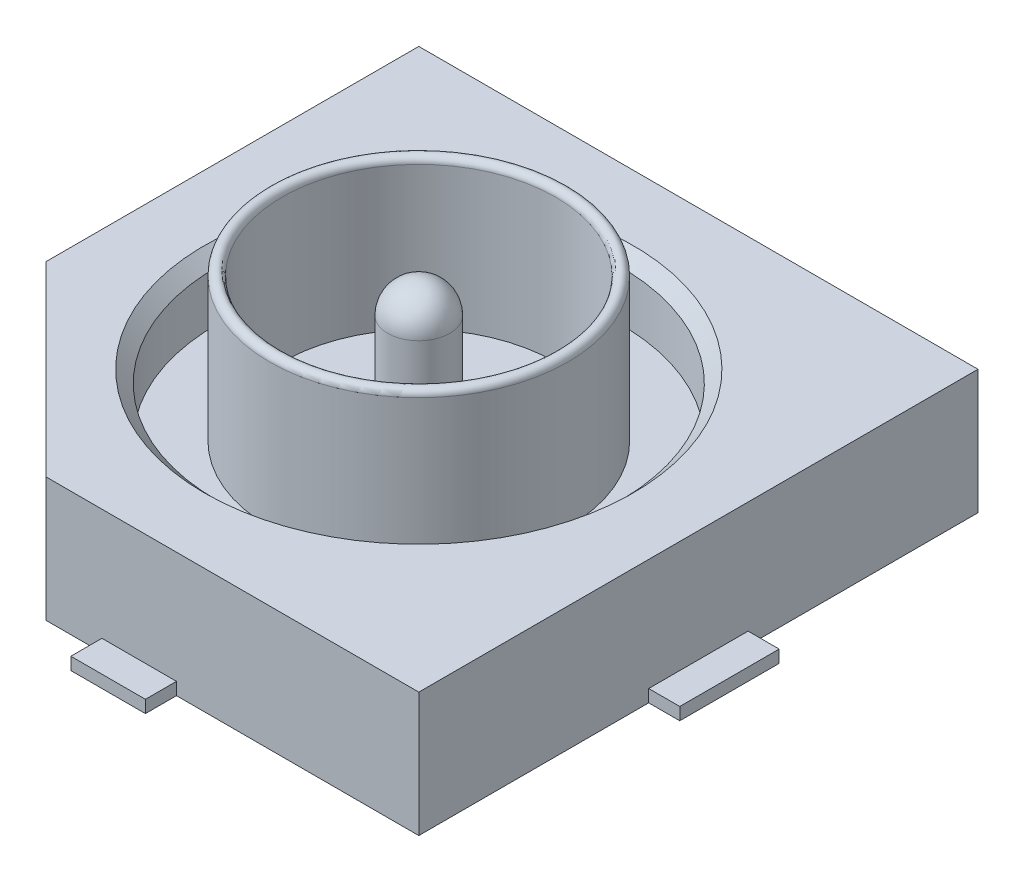
ISO-10303-21;
HEADER;
FILE_DESCRIPTION(('STEP AP214'),'2;1');
FILE_NAME('part.step','',(''),(''),'','','');
FILE_SCHEMA(('AUTOMOTIVE_DESIGN { 1 0 10303 214 1 1 1 1 }'));
ENDSEC;
DATA;
#1=APPLICATION_CONTEXT('core data for automotive mechanical design processes');
#2=APPLICATION_PROTOCOL_DEFINITION('international standard','automotive_design',2000,#1);
#3=PRODUCT_CONTEXT('',#1,'mechanical');
#4=PRODUCT('Part','Part','',(#3));
#5=PRODUCT_RELATED_PRODUCT_CATEGORY('part','',(#4));
#6=PRODUCT_DEFINITION_FORMATION('','',#4);
#7=PRODUCT_DEFINITION_CONTEXT('part definition',#1,'design');
#8=PRODUCT_DEFINITION('design','',#6,#7);
#9=PRODUCT_DEFINITION_SHAPE('','',#8);
#10=(LENGTH_UNIT() NAMED_UNIT(*) SI_UNIT(.MILLI.,.METRE.));
#11=(NAMED_UNIT(*) PLANE_ANGLE_UNIT() SI_UNIT($,.RADIAN.));
#12=(NAMED_UNIT(*) SI_UNIT($,.STERADIAN.) SOLID_ANGLE_UNIT());
#13=UNCERTAINTY_MEASURE_WITH_UNIT(LENGTH_MEASURE(1.E-05),#10,'distance_accuracy_value','');
#14=(GEOMETRIC_REPRESENTATION_CONTEXT(3) GLOBAL_UNCERTAINTY_ASSIGNED_CONTEXT((#13)) GLOBAL_UNIT_ASSIGNED_CONTEXT((#10,
#11,#12)) REPRESENTATION_CONTEXT('',''));
#15=CARTESIAN_POINT('',(0.,0.,0.));
#16=DIRECTION('',(0.,0.,1.));
#17=DIRECTION('',(1.,0.,0.));
#18=AXIS2_PLACEMENT_3D('',#15,#16,#17);
#19=CARTESIAN_POINT('',(0.,1.65,0.));
#20=DIRECTION('',(0.,-1.,0.));
#21=DIRECTION('',(0.,0.,-1.));
#22=AXIS2_PLACEMENT_3D('',#19,#20,#21);
#23=TOROIDAL_SURFACE('',#22,1.15,0.05);
#24=CARTESIAN_POINT('',(0.,1.65,0.));
#25=DIRECTION('',(0.,-1.,0.));
#26=DIRECTION('',(0.,0.,-1.));
#27=AXIS2_PLACEMENT_3D('',#24,#25,#26);
#28=CIRCLE('',#27,1.1);
#29=CARTESIAN_POINT('',(0.,1.65,-1.1));
#30=VERTEX_POINT('',#29);
#31=EDGE_CURVE('E360',#30,#30,#28,.F.);
#32=ORIENTED_EDGE('',*,*,#31,.F.);
#33=EDGE_LOOP('',(#32));
#34=FACE_BOUND('',#33,.T.);
#35=CARTESIAN_POINT('',(0.,1.65,0.));
#36=DIRECTION('',(0.,-1.,0.));
#37=DIRECTION('',(0.,0.,-1.));
#38=AXIS2_PLACEMENT_3D('',#35,#36,#37);
#39=CIRCLE('',#38,1.2);
#40=CARTESIAN_POINT('',(0.,1.65,-1.2));
#41=VERTEX_POINT('',#40);
#42=EDGE_CURVE('E365',#41,#41,#39,.T.);
#43=ORIENTED_EDGE('',*,*,#42,.F.);
#44=EDGE_LOOP('',(#43));
#45=FACE_BOUND('',#44,.T.);
#46=ADVANCED_FACE('F70',(#34,#45),#23,.T.);
#47=CARTESIAN_POINT('',(0.,1.7,0.));
#48=DIRECTION('',(0.,-1.,0.));
#49=DIRECTION('',(0.,0.,-1.));
#50=AXIS2_PLACEMENT_3D('',#47,#48,#49);
#51=CYLINDRICAL_SURFACE('',#50,1.2);
#52=ORIENTED_EDGE('',*,*,#42,.T.);
#53=EDGE_LOOP('',(#52));
#54=FACE_BOUND('',#53,.T.);
#55=CARTESIAN_POINT('',(0.,0.5,0.));
#56=DIRECTION('',(0.,1.,0.));
#57=DIRECTION('',(0.,0.,1.));
#58=AXIS2_PLACEMENT_3D('',#55,#56,#57);
#59=CIRCLE('',#58,1.2);
#60=CARTESIAN_POINT('',(0.,0.5,1.2));
#61=VERTEX_POINT('',#60);
#62=EDGE_CURVE('E324',#61,#61,#59,.T.);
#63=ORIENTED_EDGE('',*,*,#62,.T.);
#64=EDGE_LOOP('',(#63));
#65=FACE_BOUND('',#64,.T.);
#66=ADVANCED_FACE('F437',(#54,#65),#51,.T.);
#67=CARTESIAN_POINT('',(0.,1.7,0.));
#68=DIRECTION('',(0.,-1.,0.));
#69=DIRECTION('',(0.,0.,-1.));
#70=AXIS2_PLACEMENT_3D('',#67,#68,#69);
#71=CYLINDRICAL_SURFACE('',#70,1.1);
#72=ORIENTED_EDGE('',*,*,#31,.T.);
#73=EDGE_LOOP('',(#72));
#74=FACE_BOUND('',#73,.T.);
#75=CARTESIAN_POINT('',(0.,0.5,0.));
#76=DIRECTION('',(0.,1.,0.));
#77=DIRECTION('',(0.,0.,1.));
#78=AXIS2_PLACEMENT_3D('',#75,#76,#77);
#79=CIRCLE('',#78,1.1);
#80=CARTESIAN_POINT('',(0.,0.5,1.1));
#81=VERTEX_POINT('',#80);
#82=EDGE_CURVE('E318',#81,#81,#79,.T.);
#83=ORIENTED_EDGE('',*,*,#82,.F.);
#84=EDGE_LOOP('',(#83));
#85=FACE_BOUND('',#84,.T.);
#86=ADVANCED_FACE('F443',(#74,#85),#71,.F.);
#87=CARTESIAN_POINT('',(0.,0.5,0.));
#88=DIRECTION('',(0.,1.,0.));
#89=DIRECTION('',(0.,0.,1.));
#90=AXIS2_PLACEMENT_3D('',#87,#88,#89);
#91=CYLINDRICAL_SURFACE('',#90,1.625);
#92=CARTESIAN_POINT('',(0.,0.900000000000001,0.));
#93=DIRECTION('',(0.,1.,0.));
#94=DIRECTION('',(0.,0.,1.));
#95=AXIS2_PLACEMENT_3D('',#92,#93,#94);
#96=CIRCLE('',#95,1.625);
#97=CARTESIAN_POINT('',(0.,0.900000000000001,1.625));
#98=VERTEX_POINT('',#97);
#99=EDGE_CURVE('E368',#98,#98,#96,.T.);
#100=ORIENTED_EDGE('',*,*,#99,.T.);
#101=EDGE_LOOP('',(#100));
#102=FACE_BOUND('',#101,.T.);
#103=CARTESIAN_POINT('',(0.,0.5,0.));
#104=DIRECTION('',(0.,1.,0.));
#105=DIRECTION('',(0.,0.,1.));
#106=AXIS2_PLACEMENT_3D('',#103,#104,#105);
#107=CIRCLE('',#106,1.625);
#108=CARTESIAN_POINT('',(0.,0.5,1.625));
#109=VERTEX_POINT('',#108);
#110=EDGE_CURVE('E327',#109,#109,#107,.T.);
#111=ORIENTED_EDGE('',*,*,#110,.F.);
#112=EDGE_LOOP('',(#111));
#113=FACE_BOUND('',#112,.T.);
#114=ADVANCED_FACE('F466',(#102,#113),#91,.F.);
#115=CARTESIAN_POINT('',(0.,0.5,0.));
#116=DIRECTION('',(0.,1.,0.));
#117=DIRECTION('',(0.,0.,1.));
#118=AXIS2_PLACEMENT_3D('',#115,#116,#117);
#119=PLANE('',#118);
#120=ORIENTED_EDGE('',*,*,#62,.F.);
#121=EDGE_LOOP('',(#120));
#122=FACE_BOUND('',#121,.T.);
#123=ORIENTED_EDGE('',*,*,#110,.T.);
#124=EDGE_LOOP('',(#123));
#125=FACE_BOUND('',#124,.T.);
#126=ADVANCED_FACE('F469',(#122,#125),#119,.T.);
#127=CARTESIAN_POINT('',(-2.25,0.,2.25));
#128=DIRECTION('',(0.,1.,0.));
#129=DIRECTION('',(0.,0.,1.));
#130=AXIS2_PLACEMENT_3D('',#127,#128,#129);
#131=PLANE('',#130);
#132=DIRECTION('',(1.,0.,0.));
#133=VECTOR('',#132,1.);
#134=CARTESIAN_POINT('',(-2.25,0.,2.25));
#135=LINE('',#134,#133);
#136=CARTESIAN_POINT('',(-0.75,0.,2.25));
#137=VERTEX_POINT('',#136);
#138=CARTESIAN_POINT('',(-0.3,0.,2.25));
#139=VERTEX_POINT('',#138);
#140=EDGE_CURVE('E345',#137,#139,#135,.T.);
#141=ORIENTED_EDGE('',*,*,#140,.F.);
#142=DIRECTION('',(0.707106781186546,0.,0.707106781186549));
#143=VECTOR('',#142,1.);
#144=CARTESIAN_POINT('',(-0.750000000000001,0.,2.25));
#145=LINE('',#144,#143);
#146=CARTESIAN_POINT('',(-2.25,0.,0.749999999999996));
#147=VERTEX_POINT('',#146);
#148=EDGE_CURVE('E92',#137,#147,#145,.F.);
#149=ORIENTED_EDGE('',*,*,#148,.T.);
#150=DIRECTION('',(0.,0.,1.));
#151=VECTOR('',#150,1.);
#152=CARTESIAN_POINT('',(-2.25,0.,-2.25));
#153=LINE('',#152,#151);
#154=CARTESIAN_POINT('',(-2.25,0.,0.4));
#155=VERTEX_POINT('',#154);
#156=EDGE_CURVE('E344',#155,#147,#153,.T.);
#157=ORIENTED_EDGE('',*,*,#156,.F.);
#158=DIRECTION('',(-1.,0.,0.));
#159=VECTOR('',#158,1.);
#160=CARTESIAN_POINT('',(-2.5,0.,0.4));
#161=LINE('',#160,#159);
#162=CARTESIAN_POINT('',(-2.5,0.,0.4));
#163=VERTEX_POINT('',#162);
#164=EDGE_CURVE('E239',#155,#163,#161,.T.);
#165=ORIENTED_EDGE('',*,*,#164,.T.);
#166=DIRECTION('',(0.,0.,-1.));
#167=VECTOR('',#166,1.);
#168=CARTESIAN_POINT('',(-2.5,0.,0.4));
#169=LINE('',#168,#167);
#170=CARTESIAN_POINT('',(-2.5,0.,-0.4));
#171=VERTEX_POINT('',#170);
#172=EDGE_CURVE('E268',#163,#171,#169,.T.);
#173=ORIENTED_EDGE('',*,*,#172,.T.);
#174=DIRECTION('',(1.,0.,0.));
#175=VECTOR('',#174,1.);
#176=CARTESIAN_POINT('',(-2.5,0.,-0.4));
#177=LINE('',#176,#175);
#178=CARTESIAN_POINT('',(-2.25,0.,-0.4));
#179=VERTEX_POINT('',#178);
#180=EDGE_CURVE('E218',#171,#179,#177,.T.);
#181=ORIENTED_EDGE('',*,*,#180,.T.);
#182=CARTESIAN_POINT('',(-2.25,0.,-2.25));
#183=VERTEX_POINT('',#182);
#184=EDGE_CURVE('E341',#183,#179,#153,.T.);
#185=ORIENTED_EDGE('',*,*,#184,.F.);
#186=DIRECTION('',(-1.,0.,0.));
#187=VECTOR('',#186,1.);
#188=CARTESIAN_POINT('',(-2.25,0.,-2.25));
#189=LINE('',#188,#187);
#190=CARTESIAN_POINT('',(-0.4,0.,-2.25));
#191=VERTEX_POINT('',#190);
#192=EDGE_CURVE('E350',#191,#183,#189,.T.);
#193=ORIENTED_EDGE('',*,*,#192,.F.);
#194=DIRECTION('',(0.,0.,-1.));
#195=VECTOR('',#194,1.);
#196=CARTESIAN_POINT('',(-0.4,0.,-0.4));
#197=LINE('',#196,#195);
#198=CARTESIAN_POINT('',(-0.4,0.,-2.5));
#199=VERTEX_POINT('',#198);
#200=EDGE_CURVE('E271',#191,#199,#197,.T.);
#201=ORIENTED_EDGE('',*,*,#200,.T.);
#202=DIRECTION('',(1.,0.,0.));
#203=VECTOR('',#202,1.);
#204=CARTESIAN_POINT('',(-0.4,0.,-2.5));
#205=LINE('',#204,#203);
#206=CARTESIAN_POINT('',(0.4,0.,-2.5));
#207=VERTEX_POINT('',#206);
#208=EDGE_CURVE('E273',#199,#207,#205,.T.);
#209=ORIENTED_EDGE('',*,*,#208,.T.);
#210=DIRECTION('',(0.,0.,1.));
#211=VECTOR('',#210,1.);
#212=CARTESIAN_POINT('',(0.4,0.,-2.5));
#213=LINE('',#212,#211);
#214=CARTESIAN_POINT('',(0.4,0.,-2.25));
#215=VERTEX_POINT('',#214);
#216=EDGE_CURVE('E276',#207,#215,#213,.T.);
#217=ORIENTED_EDGE('',*,*,#216,.T.);
#218=CARTESIAN_POINT('',(2.25,0.,-2.25));
#219=VERTEX_POINT('',#218);
#220=EDGE_CURVE('E334',#219,#215,#189,.T.);
#221=ORIENTED_EDGE('',*,*,#220,.F.);
#222=DIRECTION('',(0.,0.,-1.));
#223=VECTOR('',#222,1.);
#224=CARTESIAN_POINT('',(2.25,0.,-2.25));
#225=LINE('',#224,#223);
#226=CARTESIAN_POINT('',(2.25,0.,-0.4));
#227=VERTEX_POINT('',#226);
#228=EDGE_CURVE('E347',#227,#219,#225,.T.);
#229=ORIENTED_EDGE('',*,*,#228,.F.);
#230=DIRECTION('',(1.,0.,0.));
#231=VECTOR('',#230,1.);
#232=CARTESIAN_POINT('',(0.4,0.,-0.4));
#233=LINE('',#232,#231);
#234=CARTESIAN_POINT('',(2.5,0.,-0.4));
#235=VERTEX_POINT('',#234);
#236=EDGE_CURVE('E279',#227,#235,#233,.T.);
#237=ORIENTED_EDGE('',*,*,#236,.T.);
#238=DIRECTION('',(0.,0.,1.));
#239=VECTOR('',#238,1.);
#240=CARTESIAN_POINT('',(2.5,0.,0.4));
#241=LINE('',#240,#239);
#242=CARTESIAN_POINT('',(2.5,0.,0.4));
#243=VERTEX_POINT('',#242);
#244=EDGE_CURVE('E281',#235,#243,#241,.T.);
#245=ORIENTED_EDGE('',*,*,#244,.T.);
#246=DIRECTION('',(-1.,0.,0.));
#247=VECTOR('',#246,1.);
#248=CARTESIAN_POINT('',(0.3,0.,0.4));
#249=LINE('',#248,#247);
#250=CARTESIAN_POINT('',(2.25,0.,0.4));
#251=VERTEX_POINT('',#250);
#252=EDGE_CURVE('E284',#243,#251,#249,.T.);
#253=ORIENTED_EDGE('',*,*,#252,.T.);
#254=CARTESIAN_POINT('',(2.25,0.,2.25));
#255=VERTEX_POINT('',#254);
#256=EDGE_CURVE('E348',#255,#251,#225,.T.);
#257=ORIENTED_EDGE('',*,*,#256,.F.);
#258=CARTESIAN_POINT('',(0.3,0.,2.25));
#259=VERTEX_POINT('',#258);
#260=EDGE_CURVE('E343',#259,#255,#135,.T.);
#261=ORIENTED_EDGE('',*,*,#260,.F.);
#262=DIRECTION('',(0.,0.,1.));
#263=VECTOR('',#262,1.);
#264=CARTESIAN_POINT('',(0.3,0.,2.5));
#265=LINE('',#264,#263);
#266=CARTESIAN_POINT('',(0.3,0.,2.5));
#267=VERTEX_POINT('',#266);
#268=EDGE_CURVE('E287',#259,#267,#265,.T.);
#269=ORIENTED_EDGE('',*,*,#268,.T.);
#270=DIRECTION('',(-1.,0.,0.));
#271=VECTOR('',#270,1.);
#272=CARTESIAN_POINT('',(-0.3,0.,2.5));
#273=LINE('',#272,#271);
#274=CARTESIAN_POINT('',(-0.3,0.,2.5));
#275=VERTEX_POINT('',#274);
#276=EDGE_CURVE('E289',#267,#275,#273,.T.);
#277=ORIENTED_EDGE('',*,*,#276,.T.);
#278=DIRECTION('',(0.,0.,-1.));
#279=VECTOR('',#278,1.);
#280=CARTESIAN_POINT('',(-0.3,0.,0.4));
#281=LINE('',#280,#279);
#282=EDGE_CURVE('E241',#275,#139,#281,.T.);
#283=ORIENTED_EDGE('',*,*,#282,.T.);
#284=EDGE_LOOP('',(#141,#149,#157,#165,#173,#181,#185,#193,#201,#209,#217,#221,#229,#237,#245,
#253,#257,#261,#269,#277,#283));
#285=FACE_BOUND('',#284,.T.);
#286=ADVANCED_FACE('F406',(#285),#131,.F.);
#287=CARTESIAN_POINT('',(-2.25,1.,-2.25));
#288=DIRECTION('',(0.,0.,1.));
#289=DIRECTION('',(1.,0.,0.));
#290=AXIS2_PLACEMENT_3D('',#287,#288,#289);
#291=PLANE('',#290);
#292=ORIENTED_EDGE('',*,*,#220,.T.);
#293=DIRECTION('',(0.,1.,0.));
#294=VECTOR('',#293,1.);
#295=CARTESIAN_POINT('',(0.4,1.,-2.25));
#296=LINE('',#295,#294);
#297=CARTESIAN_POINT('',(0.4,0.1,-2.25));
#298=VERTEX_POINT('',#297);
#299=EDGE_CURVE('E393',#215,#298,#296,.T.);
#300=ORIENTED_EDGE('',*,*,#299,.T.);
#301=DIRECTION('',(1.,0.,0.));
#302=VECTOR('',#301,1.);
#303=CARTESIAN_POINT('',(-2.25,0.1,-2.25));
#304=LINE('',#303,#302);
#305=CARTESIAN_POINT('',(-0.4,0.1,-2.25));
#306=VERTEX_POINT('',#305);
#307=EDGE_CURVE('E315',#306,#298,#304,.T.);
#308=ORIENTED_EDGE('',*,*,#307,.F.);
#309=DIRECTION('',(0.,-1.,0.));
#310=VECTOR('',#309,1.);
#311=CARTESIAN_POINT('',(-0.4,1.,-2.25));
#312=LINE('',#311,#310);
#313=EDGE_CURVE('E390',#306,#191,#312,.T.);
#314=ORIENTED_EDGE('',*,*,#313,.T.);
#315=ORIENTED_EDGE('',*,*,#192,.T.);
#316=DIRECTION('',(0.,-1.,0.));
#317=VECTOR('',#316,1.);
#318=CARTESIAN_POINT('',(-2.25,1.,-2.25));
#319=LINE('',#318,#317);
#320=CARTESIAN_POINT('',(-2.25,1.,-2.25));
#321=VERTEX_POINT('',#320);
#322=EDGE_CURVE('E340',#321,#183,#319,.T.);
#323=ORIENTED_EDGE('',*,*,#322,.F.);
#324=DIRECTION('',(-1.,0.,0.));
#325=VECTOR('',#324,1.);
#326=CARTESIAN_POINT('',(-2.25,1.,-2.25));
#327=LINE('',#326,#325);
#328=CARTESIAN_POINT('',(2.25,1.,-2.25));
#329=VERTEX_POINT('',#328);
#330=EDGE_CURVE('E338',#329,#321,#327,.T.);
#331=ORIENTED_EDGE('',*,*,#330,.F.);
#332=DIRECTION('',(0.,-1.,0.));
#333=VECTOR('',#332,1.);
#334=CARTESIAN_POINT('',(2.25,1.,-2.25));
#335=LINE('',#334,#333);
#336=EDGE_CURVE('E354',#329,#219,#335,.T.);
#337=ORIENTED_EDGE('',*,*,#336,.T.);
#338=EDGE_LOOP('',(#292,#300,#308,#314,#315,#323,#331,#337));
#339=FACE_BOUND('',#338,.T.);
#340=ADVANCED_FACE('F479',(#339),#291,.F.);
#341=CARTESIAN_POINT('',(2.25,1.,-2.25));
#342=DIRECTION('',(-1.,0.,0.));
#343=DIRECTION('',(0.,0.,1.));
#344=AXIS2_PLACEMENT_3D('',#341,#342,#343);
#345=PLANE('',#344);
#346=ORIENTED_EDGE('',*,*,#256,.T.);
#347=DIRECTION('',(0.,1.,0.));
#348=VECTOR('',#347,1.);
#349=CARTESIAN_POINT('',(2.25,1.,0.4));
#350=LINE('',#349,#348);
#351=CARTESIAN_POINT('',(2.25,0.1,0.4));
#352=VERTEX_POINT('',#351);
#353=EDGE_CURVE('E388',#251,#352,#350,.T.);
#354=ORIENTED_EDGE('',*,*,#353,.T.);
#355=DIRECTION('',(0.,0.,1.));
#356=VECTOR('',#355,1.);
#357=CARTESIAN_POINT('',(2.25,0.1,-2.25));
#358=LINE('',#357,#356);
#359=CARTESIAN_POINT('',(2.25,0.1,-0.4));
#360=VERTEX_POINT('',#359);
#361=EDGE_CURVE('E312',#360,#352,#358,.T.);
#362=ORIENTED_EDGE('',*,*,#361,.F.);
#363=DIRECTION('',(0.,-1.,0.));
#364=VECTOR('',#363,1.);
#365=CARTESIAN_POINT('',(2.25,1.,-0.4));
#366=LINE('',#365,#364);
#367=EDGE_CURVE('E385',#360,#227,#366,.T.);
#368=ORIENTED_EDGE('',*,*,#367,.T.);
#369=ORIENTED_EDGE('',*,*,#228,.T.);
#370=ORIENTED_EDGE('',*,*,#336,.F.);
#371=DIRECTION('',(0.,0.,-1.));
#372=VECTOR('',#371,1.);
#373=CARTESIAN_POINT('',(2.25,1.,-2.25));
#374=LINE('',#373,#372);
#375=CARTESIAN_POINT('',(2.25,1.,2.25));
#376=VERTEX_POINT('',#375);
#377=EDGE_CURVE('E336',#376,#329,#374,.T.);
#378=ORIENTED_EDGE('',*,*,#377,.F.);
#379=DIRECTION('',(0.,-1.,0.));
#380=VECTOR('',#379,1.);
#381=CARTESIAN_POINT('',(2.25,1.,2.25));
#382=LINE('',#381,#380);
#383=EDGE_CURVE('E357',#376,#255,#382,.T.);
#384=ORIENTED_EDGE('',*,*,#383,.T.);
#385=EDGE_LOOP('',(#346,#354,#362,#368,#369,#370,#378,#384));
#386=FACE_BOUND('',#385,.T.);
#387=ADVANCED_FACE('F495',(#386),#345,.F.);
#388=CARTESIAN_POINT('',(-2.25,1.,2.25));
#389=DIRECTION('',(0.,0.,-1.));
#390=DIRECTION('',(-1.,0.,0.));
#391=AXIS2_PLACEMENT_3D('',#388,#389,#390);
#392=PLANE('',#391);
#393=DIRECTION('',(1.,0.,0.));
#394=VECTOR('',#393,1.);
#395=CARTESIAN_POINT('',(-2.25,1.,2.25));
#396=LINE('',#395,#394);
#397=CARTESIAN_POINT('',(-0.75,1.,2.25));
#398=VERTEX_POINT('',#397);
#399=EDGE_CURVE('E333',#398,#376,#396,.T.);
#400=ORIENTED_EDGE('',*,*,#399,.F.);
#401=DIRECTION('',(0.,-1.,0.));
#402=VECTOR('',#401,1.);
#403=CARTESIAN_POINT('',(-0.750000000000001,1.,2.25));
#404=LINE('',#403,#402);
#405=EDGE_CURVE('E395',#398,#137,#404,.T.);
#406=ORIENTED_EDGE('',*,*,#405,.T.);
#407=ORIENTED_EDGE('',*,*,#140,.T.);
#408=DIRECTION('',(0.,1.,0.));
#409=VECTOR('',#408,1.);
#410=CARTESIAN_POINT('',(-0.3,1.,2.25));
#411=LINE('',#410,#409);
#412=CARTESIAN_POINT('',(-0.3,0.1,2.25));
#413=VERTEX_POINT('',#412);
#414=EDGE_CURVE('E383',#139,#413,#411,.T.);
#415=ORIENTED_EDGE('',*,*,#414,.T.);
#416=DIRECTION('',(-1.,0.,0.));
#417=VECTOR('',#416,1.);
#418=CARTESIAN_POINT('',(-2.25,0.1,2.25));
#419=LINE('',#418,#417);
#420=CARTESIAN_POINT('',(0.3,0.1,2.25));
#421=VERTEX_POINT('',#420);
#422=EDGE_CURVE('E295',#421,#413,#419,.T.);
#423=ORIENTED_EDGE('',*,*,#422,.F.);
#424=DIRECTION('',(0.,-1.,0.));
#425=VECTOR('',#424,1.);
#426=CARTESIAN_POINT('',(0.3,1.,2.25));
#427=LINE('',#426,#425);
#428=EDGE_CURVE('E380',#421,#259,#427,.T.);
#429=ORIENTED_EDGE('',*,*,#428,.T.);
#430=ORIENTED_EDGE('',*,*,#260,.T.);
#431=ORIENTED_EDGE('',*,*,#383,.F.);
#432=EDGE_LOOP('',(#400,#406,#407,#415,#423,#429,#430,#431));
#433=FACE_BOUND('',#432,.T.);
#434=ADVANCED_FACE('F401',(#433),#392,.F.);
#435=CARTESIAN_POINT('',(-2.25,1.,-2.25));
#436=DIRECTION('',(1.,0.,0.));
#437=DIRECTION('',(0.,0.,-1.));
#438=AXIS2_PLACEMENT_3D('',#435,#436,#437);
#439=PLANE('',#438);
#440=ORIENTED_EDGE('',*,*,#156,.T.);
#441=DIRECTION('',(0.,1.,0.));
#442=VECTOR('',#441,1.);
#443=CARTESIAN_POINT('',(-2.25,1.,0.749999999999996));
#444=LINE('',#443,#442);
#445=CARTESIAN_POINT('',(-2.25,1.,0.749999999999995));
#446=VERTEX_POINT('',#445);
#447=EDGE_CURVE('E78',#147,#446,#444,.T.);
#448=ORIENTED_EDGE('',*,*,#447,.T.);
#449=DIRECTION('',(0.,0.,1.));
#450=VECTOR('',#449,1.);
#451=CARTESIAN_POINT('',(-2.25,1.,-2.25));
#452=LINE('',#451,#450);
#453=EDGE_CURVE('E331',#321,#446,#452,.T.);
#454=ORIENTED_EDGE('',*,*,#453,.F.);
#455=ORIENTED_EDGE('',*,*,#322,.T.);
#456=ORIENTED_EDGE('',*,*,#184,.T.);
#457=DIRECTION('',(0.,1.,0.));
#458=VECTOR('',#457,1.);
#459=CARTESIAN_POINT('',(-2.25,1.,-0.4));
#460=LINE('',#459,#458);
#461=CARTESIAN_POINT('',(-2.25,0.1,-0.4));
#462=VERTEX_POINT('',#461);
#463=EDGE_CURVE('E375',#179,#462,#460,.T.);
#464=ORIENTED_EDGE('',*,*,#463,.T.);
#465=DIRECTION('',(0.,0.,-1.));
#466=VECTOR('',#465,1.);
#467=CARTESIAN_POINT('',(-2.25,0.1,-2.25));
#468=LINE('',#467,#466);
#469=CARTESIAN_POINT('',(-2.25,0.1,0.4));
#470=VERTEX_POINT('',#469);
#471=EDGE_CURVE('E232',#470,#462,#468,.T.);
#472=ORIENTED_EDGE('',*,*,#471,.F.);
#473=DIRECTION('',(0.,-1.,0.));
#474=VECTOR('',#473,1.);
#475=CARTESIAN_POINT('',(-2.25,1.,0.4));
#476=LINE('',#475,#474);
#477=EDGE_CURVE('E377',#470,#155,#476,.T.);
#478=ORIENTED_EDGE('',*,*,#477,.T.);
#479=EDGE_LOOP('',(#440,#448,#454,#455,#456,#464,#472,#478));
#480=FACE_BOUND('',#479,.T.);
#481=ADVANCED_FACE('F490',(#480),#439,.F.);
#482=CARTESIAN_POINT('',(-2.25,1.,2.25));
#483=DIRECTION('',(0.,1.,0.));
#484=DIRECTION('',(0.,0.,1.));
#485=AXIS2_PLACEMENT_3D('',#482,#483,#484);
#486=PLANE('',#485);
#487=CARTESIAN_POINT('',(0.,1.,0.));
#488=DIRECTION('',(0.,1.,0.));
#489=DIRECTION('',(0.,0.,1.));
#490=AXIS2_PLACEMENT_3D('',#487,#488,#489);
#491=CIRCLE('',#490,1.725);
#492=CARTESIAN_POINT('',(0.,1.,1.725));
#493=VERTEX_POINT('',#492);
#494=EDGE_CURVE('E371',#493,#493,#491,.F.);
#495=ORIENTED_EDGE('',*,*,#494,.T.);
#496=EDGE_LOOP('',(#495));
#497=FACE_BOUND('',#496,.T.);
#498=ORIENTED_EDGE('',*,*,#453,.T.);
#499=DIRECTION('',(-0.707106781186546,0.,-0.707106781186549));
#500=VECTOR('',#499,1.);
#501=CARTESIAN_POINT('',(-1.5,1.,1.5));
#502=LINE('',#501,#500);
#503=EDGE_CURVE('E12',#446,#398,#502,.F.);
#504=ORIENTED_EDGE('',*,*,#503,.T.);
#505=ORIENTED_EDGE('',*,*,#399,.T.);
#506=ORIENTED_EDGE('',*,*,#377,.T.);
#507=ORIENTED_EDGE('',*,*,#330,.T.);
#508=EDGE_LOOP('',(#498,#504,#505,#506,#507));
#509=FACE_BOUND('',#508,.T.);
#510=ADVANCED_FACE('F488',(#497,#509),#486,.T.);
#511=CARTESIAN_POINT('',(0.,0.5,0.));
#512=DIRECTION('',(0.,1.,0.));
#513=DIRECTION('',(0.,0.,1.));
#514=AXIS2_PLACEMENT_3D('',#511,#512,#513);
#515=PLANE('',#514);
#516=CARTESIAN_POINT('',(0.,0.5,0.));
#517=DIRECTION('',(0.,1.,0.));
#518=DIRECTION('',(0.,0.,1.));
#519=AXIS2_PLACEMENT_3D('',#516,#517,#518);
#520=CIRCLE('',#519,0.25);
#521=CARTESIAN_POINT('',(0.,0.5,0.25));
#522=VERTEX_POINT('',#521);
#523=EDGE_CURVE('E321',#522,#522,#520,.T.);
#524=ORIENTED_EDGE('',*,*,#523,.F.);
#525=EDGE_LOOP('',(#524));
#526=FACE_BOUND('',#525,.T.);
#527=ORIENTED_EDGE('',*,*,#82,.T.);
#528=EDGE_LOOP('',(#527));
#529=FACE_BOUND('',#528,.T.);
#530=ADVANCED_FACE('F483',(#526,#529),#515,.T.);
#531=CARTESIAN_POINT('',(0.,1.375,0.));
#532=DIRECTION('',(0.,0.,1.));
#533=DIRECTION('',(1.,0.,0.));
#534=AXIS2_PLACEMENT_3D('',#531,#532,#533);
#535=SPHERICAL_SURFACE('',#534,0.25);
#536=CARTESIAN_POINT('',(0.,1.375,0.));
#537=DIRECTION('',(0.,-1.,0.));
#538=DIRECTION('',(0.,0.,-1.));
#539=AXIS2_PLACEMENT_3D('',#536,#537,#538);
#540=SPHERICAL_SURFACE('',#539,0.25);
#541=CARTESIAN_POINT('',(0.,1.375,0.));
#542=DIRECTION('',(0.,-1.,0.));
#543=DIRECTION('',(0.,0.,-1.));
#544=AXIS2_PLACEMENT_3D('',#541,#542,#543);
#545=CIRCLE('',#544,0.25);
#546=CARTESIAN_POINT('',(0.,1.375,-0.25));
#547=VERTEX_POINT('',#546);
#548=EDGE_CURVE('E330',#547,#547,#545,.T.);
#549=ORIENTED_EDGE('',*,*,#548,.F.);
#550=EDGE_LOOP('',(#549));
#551=FACE_BOUND('',#550,.T.);
#552=ADVANCED_FACE('F449',(#551),#540,.T.);
#553=CARTESIAN_POINT('',(0.,1.375,0.));
#554=DIRECTION('',(0.,-1.,0.));
#555=DIRECTION('',(0.,0.,-1.));
#556=AXIS2_PLACEMENT_3D('',#553,#554,#555);
#557=CYLINDRICAL_SURFACE('',#556,0.25);
#558=ORIENTED_EDGE('',*,*,#548,.T.);
#559=EDGE_LOOP('',(#558));
#560=FACE_BOUND('',#559,.T.);
#561=ORIENTED_EDGE('',*,*,#523,.T.);
#562=EDGE_LOOP('',(#561));
#563=FACE_BOUND('',#562,.T.);
#564=ADVANCED_FACE('F453',(#560,#563),#557,.T.);
#565=CARTESIAN_POINT('',(0.,0.900000000000001,0.));
#566=DIRECTION('',(0.,1.,0.));
#567=DIRECTION('',(0.,0.,1.));
#568=AXIS2_PLACEMENT_3D('',#565,#566,#567);
#569=CONICAL_SURFACE('',#568,1.625,0.785398163397449);
#570=ORIENTED_EDGE('',*,*,#494,.F.);
#571=EDGE_LOOP('',(#570));
#572=FACE_BOUND('',#571,.T.);
#573=ORIENTED_EDGE('',*,*,#99,.F.);
#574=EDGE_LOOP('',(#573));
#575=FACE_BOUND('',#574,.T.);
#576=ADVANCED_FACE('F451',(#572,#575),#569,.F.);
#577=CARTESIAN_POINT('',(-2.5,0.1,0.4));
#578=DIRECTION('',(-1.,0.,0.));
#579=DIRECTION('',(0.,0.,1.));
#580=AXIS2_PLACEMENT_3D('',#577,#578,#579);
#581=PLANE('',#580);
#582=ORIENTED_EDGE('',*,*,#172,.F.);
#583=DIRECTION('',(0.,-1.,0.));
#584=VECTOR('',#583,1.);
#585=CARTESIAN_POINT('',(-2.5,0.1,0.4));
#586=LINE('',#585,#584);
#587=CARTESIAN_POINT('',(-2.5,0.1,0.4));
#588=VERTEX_POINT('',#587);
#589=EDGE_CURVE('E238',#588,#163,#586,.T.);
#590=ORIENTED_EDGE('',*,*,#589,.F.);
#591=DIRECTION('',(0.,0.,-1.));
#592=VECTOR('',#591,1.);
#593=CARTESIAN_POINT('',(-2.5,0.1,0.4));
#594=LINE('',#593,#592);
#595=CARTESIAN_POINT('',(-2.5,0.1,-0.4));
#596=VERTEX_POINT('',#595);
#597=EDGE_CURVE('E231',#588,#596,#594,.T.);
#598=ORIENTED_EDGE('',*,*,#597,.T.);
#599=DIRECTION('',(0.,-1.,0.));
#600=VECTOR('',#599,1.);
#601=CARTESIAN_POINT('',(-2.5,0.1,-0.4));
#602=LINE('',#601,#600);
#603=EDGE_CURVE('E212',#596,#171,#602,.T.);
#604=ORIENTED_EDGE('',*,*,#603,.T.);
#605=EDGE_LOOP('',(#582,#590,#598,#604));
#606=FACE_BOUND('',#605,.T.);
#607=ADVANCED_FACE('F236',(#606),#581,.T.);
#608=CARTESIAN_POINT('',(-2.5,0.1,-0.4));
#609=DIRECTION('',(0.,-1.,0.));
#610=DIRECTION('',(0.,0.,-1.));
#611=AXIS2_PLACEMENT_3D('',#608,#609,#610);
#612=PLANE('',#611);
#613=DIRECTION('',(-1.,0.,0.));
#614=VECTOR('',#613,1.);
#615=CARTESIAN_POINT('',(-2.5,0.1,0.4));
#616=LINE('',#615,#614);
#617=EDGE_CURVE('E224',#470,#588,#616,.T.);
#618=ORIENTED_EDGE('',*,*,#617,.F.);
#619=ORIENTED_EDGE('',*,*,#471,.T.);
#620=DIRECTION('',(1.,0.,0.));
#621=VECTOR('',#620,1.);
#622=CARTESIAN_POINT('',(-2.5,0.1,-0.4));
#623=LINE('',#622,#621);
#624=EDGE_CURVE('E216',#596,#462,#623,.T.);
#625=ORIENTED_EDGE('',*,*,#624,.F.);
#626=ORIENTED_EDGE('',*,*,#597,.F.);
#627=EDGE_LOOP('',(#618,#619,#625,#626));
#628=FACE_BOUND('',#627,.T.);
#629=ADVANCED_FACE('F230',(#628),#612,.F.);
#630=CARTESIAN_POINT('',(-2.5,0.1,-0.4));
#631=DIRECTION('',(0.,0.,-1.));
#632=DIRECTION('',(-1.,0.,0.));
#633=AXIS2_PLACEMENT_3D('',#630,#631,#632);
#634=PLANE('',#633);
#635=ORIENTED_EDGE('',*,*,#463,.F.);
#636=ORIENTED_EDGE('',*,*,#180,.F.);
#637=ORIENTED_EDGE('',*,*,#603,.F.);
#638=ORIENTED_EDGE('',*,*,#624,.T.);
#639=EDGE_LOOP('',(#635,#636,#637,#638));
#640=FACE_BOUND('',#639,.T.);
#641=ADVANCED_FACE('F215',(#640),#634,.T.);
#642=CARTESIAN_POINT('',(-2.5,0.1,0.4));
#643=DIRECTION('',(0.,0.,1.));
#644=DIRECTION('',(1.,0.,0.));
#645=AXIS2_PLACEMENT_3D('',#642,#643,#644);
#646=PLANE('',#645);
#647=ORIENTED_EDGE('',*,*,#477,.F.);
#648=ORIENTED_EDGE('',*,*,#617,.T.);
#649=ORIENTED_EDGE('',*,*,#589,.T.);
#650=ORIENTED_EDGE('',*,*,#164,.F.);
#651=EDGE_LOOP('',(#647,#648,#649,#650));
#652=FACE_BOUND('',#651,.T.);
#653=ADVANCED_FACE('F424',(#652),#646,.T.);
#654=CARTESIAN_POINT('',(-0.3,0.1,2.5));
#655=DIRECTION('',(0.,0.,1.));
#656=DIRECTION('',(1.,0.,0.));
#657=AXIS2_PLACEMENT_3D('',#654,#655,#656);
#658=PLANE('',#657);
#659=ORIENTED_EDGE('',*,*,#276,.F.);
#660=DIRECTION('',(0.,-1.,0.));
#661=VECTOR('',#660,1.);
#662=CARTESIAN_POINT('',(0.3,0.1,2.5));
#663=LINE('',#662,#661);
#664=CARTESIAN_POINT('',(0.3,0.1,2.5));
#665=VERTEX_POINT('',#664);
#666=EDGE_CURVE('E298',#665,#267,#663,.T.);
#667=ORIENTED_EDGE('',*,*,#666,.F.);
#668=DIRECTION('',(-1.,0.,0.));
#669=VECTOR('',#668,1.);
#670=CARTESIAN_POINT('',(-0.3,0.1,2.5));
#671=LINE('',#670,#669);
#672=CARTESIAN_POINT('',(-0.3,0.1,2.5));
#673=VERTEX_POINT('',#672);
#674=EDGE_CURVE('E261',#665,#673,#671,.T.);
#675=ORIENTED_EDGE('',*,*,#674,.T.);
#676=DIRECTION('',(0.,-1.,0.));
#677=VECTOR('',#676,1.);
#678=CARTESIAN_POINT('',(-0.3,0.1,2.5));
#679=LINE('',#678,#677);
#680=EDGE_CURVE('E296',#673,#275,#679,.T.);
#681=ORIENTED_EDGE('',*,*,#680,.T.);
#682=EDGE_LOOP('',(#659,#667,#675,#681));
#683=FACE_BOUND('',#682,.T.);
#684=ADVANCED_FACE('F422',(#683),#658,.T.);
#685=DIRECTION('',(0.,0.,1.));
#686=VECTOR('',#685,1.);
#687=CARTESIAN_POINT('',(0.3,0.1,2.5));
#688=LINE('',#687,#686);
#689=EDGE_CURVE('E259',#421,#665,#688,.T.);
#690=ORIENTED_EDGE('',*,*,#689,.F.);
#691=ORIENTED_EDGE('',*,*,#422,.T.);
#692=DIRECTION('',(0.,0.,-1.));
#693=VECTOR('',#692,1.);
#694=CARTESIAN_POINT('',(-0.3,0.1,0.4));
#695=LINE('',#694,#693);
#696=EDGE_CURVE('E264',#673,#413,#695,.T.);
#697=ORIENTED_EDGE('',*,*,#696,.F.);
#698=ORIENTED_EDGE('',*,*,#674,.F.);
#699=EDGE_LOOP('',(#690,#691,#697,#698));
#700=FACE_BOUND('',#699,.T.);
#701=ADVANCED_FACE('F415',(#700),#612,.F.);
#702=CARTESIAN_POINT('',(0.3,0.1,2.5));
#703=DIRECTION('',(1.,0.,0.));
#704=DIRECTION('',(0.,0.,-1.));
#705=AXIS2_PLACEMENT_3D('',#702,#703,#704);
#706=PLANE('',#705);
#707=ORIENTED_EDGE('',*,*,#428,.F.);
#708=ORIENTED_EDGE('',*,*,#689,.T.);
#709=ORIENTED_EDGE('',*,*,#666,.T.);
#710=ORIENTED_EDGE('',*,*,#268,.F.);
#711=EDGE_LOOP('',(#707,#708,#709,#710));
#712=FACE_BOUND('',#711,.T.);
#713=ADVANCED_FACE('F419',(#712),#706,.T.);
#714=CARTESIAN_POINT('',(-0.3,0.1,0.4));
#715=DIRECTION('',(-1.,0.,0.));
#716=DIRECTION('',(0.,0.,1.));
#717=AXIS2_PLACEMENT_3D('',#714,#715,#716);
#718=PLANE('',#717);
#719=ORIENTED_EDGE('',*,*,#414,.F.);
#720=ORIENTED_EDGE('',*,*,#282,.F.);
#721=ORIENTED_EDGE('',*,*,#680,.F.);
#722=ORIENTED_EDGE('',*,*,#696,.T.);
#723=EDGE_LOOP('',(#719,#720,#721,#722));
#724=FACE_BOUND('',#723,.T.);
#725=ADVANCED_FACE('F410',(#724),#718,.T.);
#726=CARTESIAN_POINT('',(2.5,0.1,0.4));
#727=DIRECTION('',(1.,0.,0.));
#728=DIRECTION('',(0.,0.,-1.));
#729=AXIS2_PLACEMENT_3D('',#726,#727,#728);
#730=PLANE('',#729);
#731=ORIENTED_EDGE('',*,*,#244,.F.);
#732=DIRECTION('',(0.,-1.,0.));
#733=VECTOR('',#732,1.);
#734=CARTESIAN_POINT('',(2.5,0.1,-0.4));
#735=LINE('',#734,#733);
#736=CARTESIAN_POINT('',(2.5,0.1,-0.4));
#737=VERTEX_POINT('',#736);
#738=EDGE_CURVE('E303',#737,#235,#735,.T.);
#739=ORIENTED_EDGE('',*,*,#738,.F.);
#740=DIRECTION('',(0.,0.,1.));
#741=VECTOR('',#740,1.);
#742=CARTESIAN_POINT('',(2.5,0.1,0.4));
#743=LINE('',#742,#741);
#744=CARTESIAN_POINT('',(2.5,0.1,0.4));
#745=VERTEX_POINT('',#744);
#746=EDGE_CURVE('E253',#737,#745,#743,.T.);
#747=ORIENTED_EDGE('',*,*,#746,.T.);
#748=DIRECTION('',(0.,-1.,0.));
#749=VECTOR('',#748,1.);
#750=CARTESIAN_POINT('',(2.5,0.1,0.4));
#751=LINE('',#750,#749);
#752=EDGE_CURVE('E301',#745,#243,#751,.T.);
#753=ORIENTED_EDGE('',*,*,#752,.T.);
#754=EDGE_LOOP('',(#731,#739,#747,#753));
#755=FACE_BOUND('',#754,.T.);
#756=ADVANCED_FACE('F537',(#755),#730,.T.);
#757=DIRECTION('',(1.,0.,0.));
#758=VECTOR('',#757,1.);
#759=CARTESIAN_POINT('',(0.4,0.1,-0.4));
#760=LINE('',#759,#758);
#761=EDGE_CURVE('E251',#360,#737,#760,.T.);
#762=ORIENTED_EDGE('',*,*,#761,.F.);
#763=ORIENTED_EDGE('',*,*,#361,.T.);
#764=DIRECTION('',(-1.,0.,0.));
#765=VECTOR('',#764,1.);
#766=CARTESIAN_POINT('',(0.3,0.1,0.4));
#767=LINE('',#766,#765);
#768=EDGE_CURVE('E256',#745,#352,#767,.T.);
#769=ORIENTED_EDGE('',*,*,#768,.F.);
#770=ORIENTED_EDGE('',*,*,#746,.F.);
#771=EDGE_LOOP('',(#762,#763,#769,#770));
#772=FACE_BOUND('',#771,.T.);
#773=ADVANCED_FACE('F431',(#772),#612,.F.);
#774=CARTESIAN_POINT('',(0.4,0.1,-0.4));
#775=DIRECTION('',(0.,0.,-1.));
#776=DIRECTION('',(-1.,0.,0.));
#777=AXIS2_PLACEMENT_3D('',#774,#775,#776);
#778=PLANE('',#777);
#779=ORIENTED_EDGE('',*,*,#367,.F.);
#780=ORIENTED_EDGE('',*,*,#761,.T.);
#781=ORIENTED_EDGE('',*,*,#738,.T.);
#782=ORIENTED_EDGE('',*,*,#236,.F.);
#783=EDGE_LOOP('',(#779,#780,#781,#782));
#784=FACE_BOUND('',#783,.T.);
#785=ADVANCED_FACE('F536',(#784),#778,.T.);
#786=CARTESIAN_POINT('',(0.3,0.1,0.4));
#787=DIRECTION('',(0.,0.,1.));
#788=DIRECTION('',(1.,0.,0.));
#789=AXIS2_PLACEMENT_3D('',#786,#787,#788);
#790=PLANE('',#789);
#791=ORIENTED_EDGE('',*,*,#353,.F.);
#792=ORIENTED_EDGE('',*,*,#252,.F.);
#793=ORIENTED_EDGE('',*,*,#752,.F.);
#794=ORIENTED_EDGE('',*,*,#768,.T.);
#795=EDGE_LOOP('',(#791,#792,#793,#794));
#796=FACE_BOUND('',#795,.T.);
#797=ADVANCED_FACE('F549',(#796),#790,.T.);
#798=CARTESIAN_POINT('',(0.4,0.1,-2.5));
#799=DIRECTION('',(1.,0.,0.));
#800=DIRECTION('',(0.,0.,-1.));
#801=AXIS2_PLACEMENT_3D('',#798,#799,#800);
#802=PLANE('',#801);
#803=ORIENTED_EDGE('',*,*,#299,.F.);
#804=ORIENTED_EDGE('',*,*,#216,.F.);
#805=DIRECTION('',(0.,-1.,0.));
#806=VECTOR('',#805,1.);
#807=CARTESIAN_POINT('',(0.4,0.1,-2.5));
#808=LINE('',#807,#806);
#809=CARTESIAN_POINT('',(0.4,0.1,-2.5));
#810=VERTEX_POINT('',#809);
#811=EDGE_CURVE('E306',#810,#207,#808,.T.);
#812=ORIENTED_EDGE('',*,*,#811,.F.);
#813=DIRECTION('',(0.,0.,1.));
#814=VECTOR('',#813,1.);
#815=CARTESIAN_POINT('',(0.4,0.1,-2.5));
#816=LINE('',#815,#814);
#817=EDGE_CURVE('E248',#810,#298,#816,.T.);
#818=ORIENTED_EDGE('',*,*,#817,.T.);
#819=EDGE_LOOP('',(#803,#804,#812,#818));
#820=FACE_BOUND('',#819,.T.);
#821=ADVANCED_FACE('F524',(#820),#802,.T.);
#822=CARTESIAN_POINT('',(-0.4,0.1,-0.4));
#823=DIRECTION('',(-1.,0.,0.));
#824=DIRECTION('',(0.,0.,1.));
#825=AXIS2_PLACEMENT_3D('',#822,#823,#824);
#826=PLANE('',#825);
#827=ORIENTED_EDGE('',*,*,#313,.F.);
#828=DIRECTION('',(0.,0.,-1.));
#829=VECTOR('',#828,1.);
#830=CARTESIAN_POINT('',(-0.4,0.1,-0.4));
#831=LINE('',#830,#829);
#832=CARTESIAN_POINT('',(-0.4,0.1,-2.5));
#833=VERTEX_POINT('',#832);
#834=EDGE_CURVE('E233',#306,#833,#831,.T.);
#835=ORIENTED_EDGE('',*,*,#834,.T.);
#836=DIRECTION('',(0.,-1.,0.));
#837=VECTOR('',#836,1.);
#838=CARTESIAN_POINT('',(-0.4,0.1,-2.5));
#839=LINE('',#838,#837);
#840=EDGE_CURVE('E223',#833,#199,#839,.T.);
#841=ORIENTED_EDGE('',*,*,#840,.T.);
#842=ORIENTED_EDGE('',*,*,#200,.F.);
#843=EDGE_LOOP('',(#827,#835,#841,#842));
#844=FACE_BOUND('',#843,.T.);
#845=ADVANCED_FACE('F514',(#844),#826,.T.);
#846=ORIENTED_EDGE('',*,*,#834,.F.);
#847=ORIENTED_EDGE('',*,*,#307,.T.);
#848=ORIENTED_EDGE('',*,*,#817,.F.);
#849=DIRECTION('',(1.,0.,0.));
#850=VECTOR('',#849,1.);
#851=CARTESIAN_POINT('',(-0.4,0.1,-2.5));
#852=LINE('',#851,#850);
#853=EDGE_CURVE('E245',#833,#810,#852,.T.);
#854=ORIENTED_EDGE('',*,*,#853,.F.);
#855=EDGE_LOOP('',(#846,#847,#848,#854));
#856=FACE_BOUND('',#855,.T.);
#857=ADVANCED_FACE('F527',(#856),#612,.F.);
#858=CARTESIAN_POINT('',(-0.4,0.1,-2.5));
#859=DIRECTION('',(0.,0.,-1.));
#860=DIRECTION('',(-1.,0.,0.));
#861=AXIS2_PLACEMENT_3D('',#858,#859,#860);
#862=PLANE('',#861);
#863=ORIENTED_EDGE('',*,*,#208,.F.);
#864=ORIENTED_EDGE('',*,*,#840,.F.);
#865=ORIENTED_EDGE('',*,*,#853,.T.);
#866=ORIENTED_EDGE('',*,*,#811,.T.);
#867=EDGE_LOOP('',(#863,#864,#865,#866));
#868=FACE_BOUND('',#867,.T.);
#869=ADVANCED_FACE('F519',(#868),#862,.T.);
#870=CARTESIAN_POINT('',(-0.750000000000001,1.,2.25));
#871=DIRECTION('',(0.707106781186549,0.,-0.707106781186546));
#872=DIRECTION('',(-0.707106781186546,0.,-0.707106781186549));
#873=AXIS2_PLACEMENT_3D('',#870,#871,#872);
#874=PLANE('',#873);
#875=ORIENTED_EDGE('',*,*,#503,.F.);
#876=ORIENTED_EDGE('',*,*,#447,.F.);
#877=ORIENTED_EDGE('',*,*,#148,.F.);
#878=ORIENTED_EDGE('',*,*,#405,.F.);
#879=EDGE_LOOP('',(#875,#876,#877,#878));
#880=FACE_BOUND('',#879,.T.);
#881=ADVANCED_FACE('F72',(#880),#874,.F.);
#882=CLOSED_SHELL('',(#46,#66,#86,#114,#126,#286,#340,#387,#434,#481,#510,#530,#552,#564,#576,
#607,#629,#641,#653,#684,#701,#713,#725,#756,#773,#785,#797,#821,#845,#857,#869,#881));
#883=MANIFOLD_SOLID_BREP('B2',#882);
#884=ADVANCED_BREP_SHAPE_REPRESENTATION('',(#18,#883),#14);
#885=SHAPE_DEFINITION_REPRESENTATION(#9,#884);
ENDSEC;
END-ISO-10303-21;
